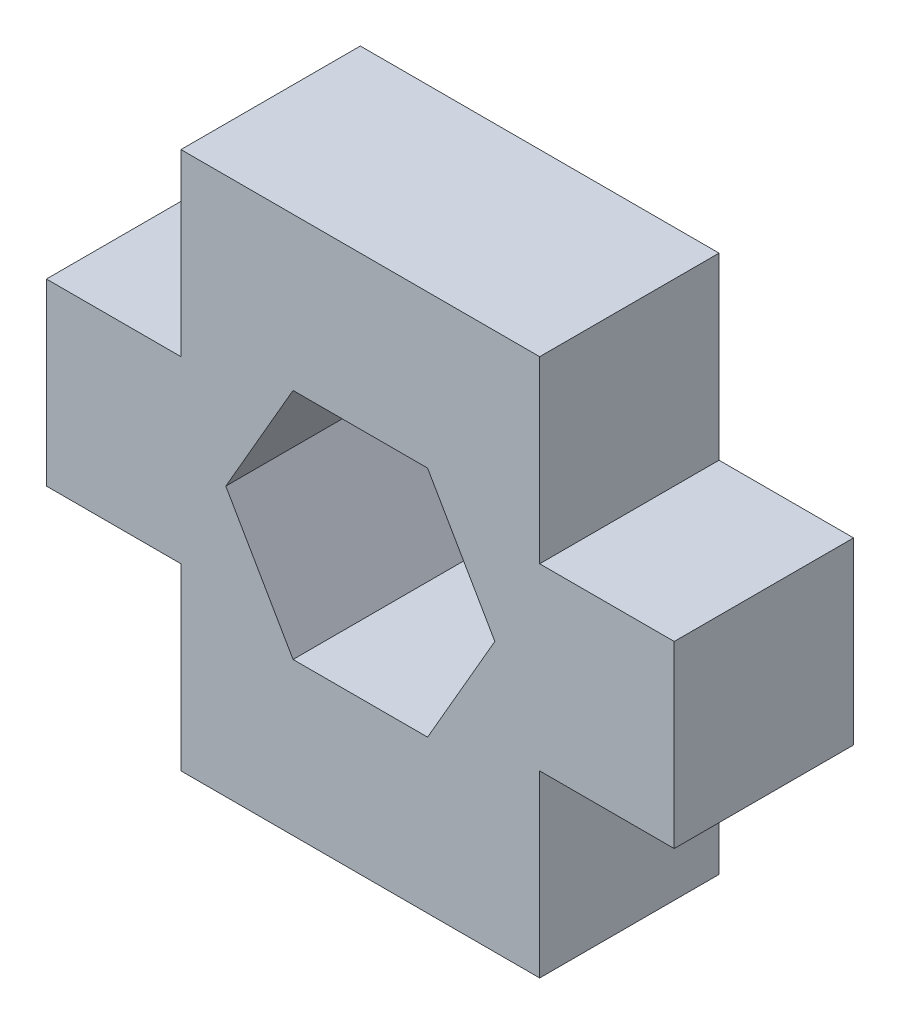
ISO-10303-21;
HEADER;
FILE_DESCRIPTION(('STEP AP214'),'2;1');
FILE_NAME('part.step','',(''),(''),'','','');
FILE_SCHEMA(('AUTOMOTIVE_DESIGN { 1 0 10303 214 1 1 1 1 }'));
ENDSEC;
DATA;
#1=APPLICATION_CONTEXT('core data for automotive mechanical design processes');
#2=APPLICATION_PROTOCOL_DEFINITION('international standard','automotive_design',2000,#1);
#3=PRODUCT_CONTEXT('',#1,'mechanical');
#4=PRODUCT('Part','Part','',(#3));
#5=PRODUCT_RELATED_PRODUCT_CATEGORY('part','',(#4));
#6=PRODUCT_DEFINITION_FORMATION('','',#4);
#7=PRODUCT_DEFINITION_CONTEXT('part definition',#1,'design');
#8=PRODUCT_DEFINITION('design','',#6,#7);
#9=PRODUCT_DEFINITION_SHAPE('','',#8);
#10=(LENGTH_UNIT() NAMED_UNIT(*) SI_UNIT(.MILLI.,.METRE.));
#11=(NAMED_UNIT(*) PLANE_ANGLE_UNIT() SI_UNIT($,.RADIAN.));
#12=(NAMED_UNIT(*) SI_UNIT($,.STERADIAN.) SOLID_ANGLE_UNIT());
#13=UNCERTAINTY_MEASURE_WITH_UNIT(LENGTH_MEASURE(1.E-05),#10,'distance_accuracy_value','');
#14=(GEOMETRIC_REPRESENTATION_CONTEXT(3) GLOBAL_UNCERTAINTY_ASSIGNED_CONTEXT((#13)) GLOBAL_UNIT_ASSIGNED_CONTEXT((#10,
#11,#12)) REPRESENTATION_CONTEXT('',''));
#15=CARTESIAN_POINT('',(0.,0.,0.));
#16=DIRECTION('',(0.,0.,1.));
#17=DIRECTION('',(1.,0.,0.));
#18=AXIS2_PLACEMENT_3D('',#15,#16,#17);
#19=CARTESIAN_POINT('',(0.,0.,4.));
#20=DIRECTION('',(0.,0.,1.));
#21=DIRECTION('',(1.,0.,0.));
#22=AXIS2_PLACEMENT_3D('',#19,#20,#21);
#23=PLANE('',#22);
#24=DIRECTION('',(0.,-1.,0.));
#25=VECTOR('',#24,1.);
#26=CARTESIAN_POINT('',(0.,4.,4.));
#27=LINE('',#26,#25);
#28=CARTESIAN_POINT('',(0.,4.,4.));
#29=VERTEX_POINT('',#28);
#30=CARTESIAN_POINT('',(0.,0.,4.));
#31=VERTEX_POINT('',#30);
#32=EDGE_CURVE('E209',#29,#31,#27,.T.);
#33=ORIENTED_EDGE('',*,*,#32,.T.);
#34=DIRECTION('',(1.,0.,0.));
#35=VECTOR('',#34,1.);
#36=CARTESIAN_POINT('',(0.,0.,4.));
#37=LINE('',#36,#35);
#38=CARTESIAN_POINT('',(8.,0.,4.));
#39=VERTEX_POINT('',#38);
#40=EDGE_CURVE('E212',#31,#39,#37,.T.);
#41=ORIENTED_EDGE('',*,*,#40,.T.);
#42=DIRECTION('',(0.,1.,0.));
#43=VECTOR('',#42,1.);
#44=CARTESIAN_POINT('',(8.,0.,4.));
#45=LINE('',#44,#43);
#46=CARTESIAN_POINT('',(8.,4.,4.));
#47=VERTEX_POINT('',#46);
#48=EDGE_CURVE('E215',#39,#47,#45,.T.);
#49=ORIENTED_EDGE('',*,*,#48,.T.);
#50=DIRECTION('',(1.,0.,0.));
#51=VECTOR('',#50,1.);
#52=CARTESIAN_POINT('',(8.,4.,4.));
#53=LINE('',#52,#51);
#54=CARTESIAN_POINT('',(11.,4.,4.));
#55=VERTEX_POINT('',#54);
#56=EDGE_CURVE('E217',#47,#55,#53,.T.);
#57=ORIENTED_EDGE('',*,*,#56,.T.);
#58=DIRECTION('',(0.,1.,0.));
#59=VECTOR('',#58,1.);
#60=CARTESIAN_POINT('',(11.,4.,4.));
#61=LINE('',#60,#59);
#62=CARTESIAN_POINT('',(11.,8.,4.));
#63=VERTEX_POINT('',#62);
#64=EDGE_CURVE('E219',#55,#63,#61,.T.);
#65=ORIENTED_EDGE('',*,*,#64,.T.);
#66=DIRECTION('',(-1.,0.,0.));
#67=VECTOR('',#66,1.);
#68=CARTESIAN_POINT('',(8.,8.,4.));
#69=LINE('',#68,#67);
#70=CARTESIAN_POINT('',(8.,8.,4.));
#71=VERTEX_POINT('',#70);
#72=EDGE_CURVE('E221',#63,#71,#69,.T.);
#73=ORIENTED_EDGE('',*,*,#72,.T.);
#74=DIRECTION('',(0.,1.,0.));
#75=VECTOR('',#74,1.);
#76=CARTESIAN_POINT('',(8.,8.,4.));
#77=LINE('',#76,#75);
#78=CARTESIAN_POINT('',(8.,12.,4.));
#79=VERTEX_POINT('',#78);
#80=EDGE_CURVE('E223',#71,#79,#77,.T.);
#81=ORIENTED_EDGE('',*,*,#80,.T.);
#82=DIRECTION('',(-1.,0.,0.));
#83=VECTOR('',#82,1.);
#84=CARTESIAN_POINT('',(8.,12.,4.));
#85=LINE('',#84,#83);
#86=CARTESIAN_POINT('',(0.,12.,4.));
#87=VERTEX_POINT('',#86);
#88=EDGE_CURVE('E225',#79,#87,#85,.T.);
#89=ORIENTED_EDGE('',*,*,#88,.T.);
#90=DIRECTION('',(0.,-1.,0.));
#91=VECTOR('',#90,1.);
#92=CARTESIAN_POINT('',(0.,12.,4.));
#93=LINE('',#92,#91);
#94=CARTESIAN_POINT('',(0.,8.,4.));
#95=VERTEX_POINT('',#94);
#96=EDGE_CURVE('E227',#87,#95,#93,.T.);
#97=ORIENTED_EDGE('',*,*,#96,.T.);
#98=DIRECTION('',(-1.,0.,0.));
#99=VECTOR('',#98,1.);
#100=CARTESIAN_POINT('',(0.,8.,4.));
#101=LINE('',#100,#99);
#102=CARTESIAN_POINT('',(-3.,8.,4.));
#103=VERTEX_POINT('',#102);
#104=EDGE_CURVE('E229',#95,#103,#101,.T.);
#105=ORIENTED_EDGE('',*,*,#104,.T.);
#106=DIRECTION('',(0.,-1.,0.));
#107=VECTOR('',#106,1.);
#108=CARTESIAN_POINT('',(-3.,8.,4.));
#109=LINE('',#108,#107);
#110=CARTESIAN_POINT('',(-3.,4.,4.));
#111=VERTEX_POINT('',#110);
#112=EDGE_CURVE('E231',#103,#111,#109,.T.);
#113=ORIENTED_EDGE('',*,*,#112,.T.);
#114=DIRECTION('',(1.,0.,0.));
#115=VECTOR('',#114,1.);
#116=CARTESIAN_POINT('',(-3.,4.,4.));
#117=LINE('',#116,#115);
#118=EDGE_CURVE('E233',#111,#29,#117,.T.);
#119=ORIENTED_EDGE('',*,*,#118,.T.);
#120=EDGE_LOOP('',(#33,#41,#49,#57,#65,#73,#81,#89,#97,#105,#113,#119));
#121=FACE_BOUND('',#120,.T.);
#122=DIRECTION('',(-0.5,0.866025403784439,0.));
#123=VECTOR('',#122,1.);
#124=CARTESIAN_POINT('',(7.00000000000003,5.99999999999998,4.));
#125=LINE('',#124,#123);
#126=CARTESIAN_POINT('',(7.00000000000003,5.99999999999998,4.));
#127=VERTEX_POINT('',#126);
#128=CARTESIAN_POINT('',(5.50000000000002,8.59807621135331,4.));
#129=VERTEX_POINT('',#128);
#130=EDGE_CURVE('E166',#127,#129,#125,.T.);
#131=ORIENTED_EDGE('',*,*,#130,.F.);
#132=DIRECTION('',(0.5,0.866025403784439,0.));
#133=VECTOR('',#132,1.);
#134=CARTESIAN_POINT('',(5.50000000000002,3.40192378864665,4.));
#135=LINE('',#134,#133);
#136=CARTESIAN_POINT('',(5.50000000000002,3.40192378864665,4.));
#137=VERTEX_POINT('',#136);
#138=EDGE_CURVE('E158',#137,#127,#135,.T.);
#139=ORIENTED_EDGE('',*,*,#138,.F.);
#140=DIRECTION('',(1.,0.,0.));
#141=VECTOR('',#140,1.);
#142=CARTESIAN_POINT('',(2.50000000000001,3.40192378864666,4.));
#143=LINE('',#142,#141);
#144=CARTESIAN_POINT('',(2.50000000000001,3.40192378864666,4.));
#145=VERTEX_POINT('',#144);
#146=EDGE_CURVE('E187',#145,#137,#143,.T.);
#147=ORIENTED_EDGE('',*,*,#146,.F.);
#148=DIRECTION('',(0.5,-0.866025403784438,0.));
#149=VECTOR('',#148,1.);
#150=CARTESIAN_POINT('',(1.,5.99999999999998,4.));
#151=LINE('',#150,#149);
#152=CARTESIAN_POINT('',(1.,5.99999999999998,4.));
#153=VERTEX_POINT('',#152);
#154=EDGE_CURVE('E185',#153,#145,#151,.T.);
#155=ORIENTED_EDGE('',*,*,#154,.F.);
#156=DIRECTION('',(-0.5,-0.866025403784439,0.));
#157=VECTOR('',#156,1.);
#158=CARTESIAN_POINT('',(2.50000000000001,8.59807621135331,4.));
#159=LINE('',#158,#157);
#160=CARTESIAN_POINT('',(2.50000000000001,8.59807621135331,4.));
#161=VERTEX_POINT('',#160);
#162=EDGE_CURVE('E181',#161,#153,#159,.T.);
#163=ORIENTED_EDGE('',*,*,#162,.F.);
#164=DIRECTION('',(-1.,0.,0.));
#165=VECTOR('',#164,1.);
#166=CARTESIAN_POINT('',(5.50000000000002,8.59807621135331,4.));
#167=LINE('',#166,#165);
#168=EDGE_CURVE('E179',#129,#161,#167,.T.);
#169=ORIENTED_EDGE('',*,*,#168,.F.);
#170=EDGE_LOOP('',(#131,#139,#147,#155,#163,#169));
#171=FACE_BOUND('',#170,.T.);
#172=ADVANCED_FACE('F33',(#121,#171),#23,.T.);
#173=CARTESIAN_POINT('',(0.,0.,0.));
#174=DIRECTION('',(0.,0.,1.));
#175=DIRECTION('',(1.,0.,0.));
#176=AXIS2_PLACEMENT_3D('',#173,#174,#175);
#177=PLANE('',#176);
#178=DIRECTION('',(0.,-1.,0.));
#179=VECTOR('',#178,1.);
#180=CARTESIAN_POINT('',(0.,4.,0.));
#181=LINE('',#180,#179);
#182=CARTESIAN_POINT('',(0.,4.,0.));
#183=VERTEX_POINT('',#182);
#184=CARTESIAN_POINT('',(0.,0.,0.));
#185=VERTEX_POINT('',#184);
#186=EDGE_CURVE('E174',#183,#185,#181,.T.);
#187=ORIENTED_EDGE('',*,*,#186,.F.);
#188=DIRECTION('',(1.,0.,0.));
#189=VECTOR('',#188,1.);
#190=CARTESIAN_POINT('',(-3.,4.,0.));
#191=LINE('',#190,#189);
#192=CARTESIAN_POINT('',(-3.,4.,0.));
#193=VERTEX_POINT('',#192);
#194=EDGE_CURVE('E213',#193,#183,#191,.T.);
#195=ORIENTED_EDGE('',*,*,#194,.F.);
#196=DIRECTION('',(0.,-1.,0.));
#197=VECTOR('',#196,1.);
#198=CARTESIAN_POINT('',(-3.,8.,0.));
#199=LINE('',#198,#197);
#200=CARTESIAN_POINT('',(-3.,8.,0.));
#201=VERTEX_POINT('',#200);
#202=EDGE_CURVE('E256',#201,#193,#199,.T.);
#203=ORIENTED_EDGE('',*,*,#202,.F.);
#204=DIRECTION('',(-1.,0.,0.));
#205=VECTOR('',#204,1.);
#206=CARTESIAN_POINT('',(0.,8.,0.));
#207=LINE('',#206,#205);
#208=CARTESIAN_POINT('',(0.,8.,0.));
#209=VERTEX_POINT('',#208);
#210=EDGE_CURVE('E254',#209,#201,#207,.T.);
#211=ORIENTED_EDGE('',*,*,#210,.F.);
#212=DIRECTION('',(0.,-1.,0.));
#213=VECTOR('',#212,1.);
#214=CARTESIAN_POINT('',(0.,12.,0.));
#215=LINE('',#214,#213);
#216=CARTESIAN_POINT('',(0.,12.,0.));
#217=VERTEX_POINT('',#216);
#218=EDGE_CURVE('E252',#217,#209,#215,.T.);
#219=ORIENTED_EDGE('',*,*,#218,.F.);
#220=DIRECTION('',(-1.,0.,0.));
#221=VECTOR('',#220,1.);
#222=CARTESIAN_POINT('',(8.,12.,0.));
#223=LINE('',#222,#221);
#224=CARTESIAN_POINT('',(8.,12.,0.));
#225=VERTEX_POINT('',#224);
#226=EDGE_CURVE('E250',#225,#217,#223,.T.);
#227=ORIENTED_EDGE('',*,*,#226,.F.);
#228=DIRECTION('',(0.,1.,0.));
#229=VECTOR('',#228,1.);
#230=CARTESIAN_POINT('',(8.,8.,0.));
#231=LINE('',#230,#229);
#232=CARTESIAN_POINT('',(8.,8.,0.));
#233=VERTEX_POINT('',#232);
#234=EDGE_CURVE('E248',#233,#225,#231,.T.);
#235=ORIENTED_EDGE('',*,*,#234,.F.);
#236=DIRECTION('',(-1.,0.,0.));
#237=VECTOR('',#236,1.);
#238=CARTESIAN_POINT('',(8.,8.,0.));
#239=LINE('',#238,#237);
#240=CARTESIAN_POINT('',(11.,8.,0.));
#241=VERTEX_POINT('',#240);
#242=EDGE_CURVE('E246',#241,#233,#239,.T.);
#243=ORIENTED_EDGE('',*,*,#242,.F.);
#244=DIRECTION('',(0.,1.,0.));
#245=VECTOR('',#244,1.);
#246=CARTESIAN_POINT('',(11.,4.,0.));
#247=LINE('',#246,#245);
#248=CARTESIAN_POINT('',(11.,4.,0.));
#249=VERTEX_POINT('',#248);
#250=EDGE_CURVE('E244',#249,#241,#247,.T.);
#251=ORIENTED_EDGE('',*,*,#250,.F.);
#252=DIRECTION('',(1.,0.,0.));
#253=VECTOR('',#252,1.);
#254=CARTESIAN_POINT('',(8.,4.,0.));
#255=LINE('',#254,#253);
#256=CARTESIAN_POINT('',(8.,4.,0.));
#257=VERTEX_POINT('',#256);
#258=EDGE_CURVE('E242',#257,#249,#255,.T.);
#259=ORIENTED_EDGE('',*,*,#258,.F.);
#260=DIRECTION('',(0.,1.,0.));
#261=VECTOR('',#260,1.);
#262=CARTESIAN_POINT('',(8.,0.,0.));
#263=LINE('',#262,#261);
#264=CARTESIAN_POINT('',(8.,0.,0.));
#265=VERTEX_POINT('',#264);
#266=EDGE_CURVE('E240',#265,#257,#263,.T.);
#267=ORIENTED_EDGE('',*,*,#266,.F.);
#268=DIRECTION('',(1.,0.,0.));
#269=VECTOR('',#268,1.);
#270=CARTESIAN_POINT('',(0.,0.,0.));
#271=LINE('',#270,#269);
#272=EDGE_CURVE('E238',#185,#265,#271,.T.);
#273=ORIENTED_EDGE('',*,*,#272,.F.);
#274=EDGE_LOOP('',(#187,#195,#203,#211,#219,#227,#235,#243,#251,#259,#267,#273));
#275=FACE_BOUND('',#274,.T.);
#276=DIRECTION('',(0.5,0.866025403784439,0.));
#277=VECTOR('',#276,1.);
#278=CARTESIAN_POINT('',(5.50000000000002,3.40192378864665,0.));
#279=LINE('',#278,#277);
#280=CARTESIAN_POINT('',(5.50000000000002,3.40192378864665,0.));
#281=VERTEX_POINT('',#280);
#282=CARTESIAN_POINT('',(7.00000000000003,5.99999999999998,0.));
#283=VERTEX_POINT('',#282);
#284=EDGE_CURVE('E56',#281,#283,#279,.T.);
#285=ORIENTED_EDGE('',*,*,#284,.T.);
#286=DIRECTION('',(-0.5,0.866025403784439,0.));
#287=VECTOR('',#286,1.);
#288=CARTESIAN_POINT('',(7.00000000000003,5.99999999999998,0.));
#289=LINE('',#288,#287);
#290=CARTESIAN_POINT('',(5.50000000000002,8.59807621135331,0.));
#291=VERTEX_POINT('',#290);
#292=EDGE_CURVE('E173',#283,#291,#289,.T.);
#293=ORIENTED_EDGE('',*,*,#292,.T.);
#294=DIRECTION('',(-1.,0.,0.));
#295=VECTOR('',#294,1.);
#296=CARTESIAN_POINT('',(5.50000000000002,8.59807621135331,0.));
#297=LINE('',#296,#295);
#298=CARTESIAN_POINT('',(2.50000000000001,8.59807621135331,0.));
#299=VERTEX_POINT('',#298);
#300=EDGE_CURVE('E191',#291,#299,#297,.T.);
#301=ORIENTED_EDGE('',*,*,#300,.T.);
#302=DIRECTION('',(-0.5,-0.866025403784439,0.));
#303=VECTOR('',#302,1.);
#304=CARTESIAN_POINT('',(2.50000000000001,8.59807621135331,0.));
#305=LINE('',#304,#303);
#306=CARTESIAN_POINT('',(1.,5.99999999999998,0.));
#307=VERTEX_POINT('',#306);
#308=EDGE_CURVE('E194',#299,#307,#305,.T.);
#309=ORIENTED_EDGE('',*,*,#308,.T.);
#310=DIRECTION('',(0.5,-0.866025403784438,0.));
#311=VECTOR('',#310,1.);
#312=CARTESIAN_POINT('',(1.,5.99999999999998,0.));
#313=LINE('',#312,#311);
#314=CARTESIAN_POINT('',(2.50000000000001,3.40192378864666,0.));
#315=VERTEX_POINT('',#314);
#316=EDGE_CURVE('E197',#307,#315,#313,.T.);
#317=ORIENTED_EDGE('',*,*,#316,.T.);
#318=DIRECTION('',(1.,0.,0.));
#319=VECTOR('',#318,1.);
#320=CARTESIAN_POINT('',(2.50000000000001,3.40192378864666,0.));
#321=LINE('',#320,#319);
#322=EDGE_CURVE('E167',#315,#281,#321,.T.);
#323=ORIENTED_EDGE('',*,*,#322,.T.);
#324=EDGE_LOOP('',(#285,#293,#301,#309,#317,#323));
#325=FACE_BOUND('',#324,.T.);
#326=ADVANCED_FACE('F298',(#275,#325),#177,.F.);
#327=CARTESIAN_POINT('',(0.,4.,4.));
#328=DIRECTION('',(1.,0.,0.));
#329=DIRECTION('',(0.,0.,-1.));
#330=AXIS2_PLACEMENT_3D('',#327,#328,#329);
#331=PLANE('',#330);
#332=ORIENTED_EDGE('',*,*,#186,.T.);
#333=DIRECTION('',(0.,0.,-1.));
#334=VECTOR('',#333,1.);
#335=CARTESIAN_POINT('',(0.,0.,4.));
#336=LINE('',#335,#334);
#337=EDGE_CURVE('E11',#31,#185,#336,.T.);
#338=ORIENTED_EDGE('',*,*,#337,.F.);
#339=ORIENTED_EDGE('',*,*,#32,.F.);
#340=DIRECTION('',(0.,0.,-1.));
#341=VECTOR('',#340,1.);
#342=CARTESIAN_POINT('',(0.,4.,4.));
#343=LINE('',#342,#341);
#344=EDGE_CURVE('E235',#29,#183,#343,.T.);
#345=ORIENTED_EDGE('',*,*,#344,.T.);
#346=EDGE_LOOP('',(#332,#338,#339,#345));
#347=FACE_BOUND('',#346,.T.);
#348=ADVANCED_FACE('F35',(#347),#331,.F.);
#349=CARTESIAN_POINT('',(0.,0.,4.));
#350=DIRECTION('',(0.,1.,0.));
#351=DIRECTION('',(0.,0.,1.));
#352=AXIS2_PLACEMENT_3D('',#349,#350,#351);
#353=PLANE('',#352);
#354=ORIENTED_EDGE('',*,*,#272,.T.);
#355=DIRECTION('',(0.,0.,-1.));
#356=VECTOR('',#355,1.);
#357=CARTESIAN_POINT('',(8.,0.,4.));
#358=LINE('',#357,#356);
#359=EDGE_CURVE('E41',#39,#265,#358,.T.);
#360=ORIENTED_EDGE('',*,*,#359,.F.);
#361=ORIENTED_EDGE('',*,*,#40,.F.);
#362=ORIENTED_EDGE('',*,*,#337,.T.);
#363=EDGE_LOOP('',(#354,#360,#361,#362));
#364=FACE_BOUND('',#363,.T.);
#365=ADVANCED_FACE('F315',(#364),#353,.F.);
#366=CARTESIAN_POINT('',(8.,0.,4.));
#367=DIRECTION('',(-1.,0.,0.));
#368=DIRECTION('',(0.,0.,1.));
#369=AXIS2_PLACEMENT_3D('',#366,#367,#368);
#370=PLANE('',#369);
#371=ORIENTED_EDGE('',*,*,#266,.T.);
#372=DIRECTION('',(0.,0.,-1.));
#373=VECTOR('',#372,1.);
#374=CARTESIAN_POINT('',(8.,4.,4.));
#375=LINE('',#374,#373);
#376=EDGE_CURVE('E285',#47,#257,#375,.T.);
#377=ORIENTED_EDGE('',*,*,#376,.F.);
#378=ORIENTED_EDGE('',*,*,#48,.F.);
#379=ORIENTED_EDGE('',*,*,#359,.T.);
#380=EDGE_LOOP('',(#371,#377,#378,#379));
#381=FACE_BOUND('',#380,.T.);
#382=ADVANCED_FACE('F292',(#381),#370,.F.);
#383=CARTESIAN_POINT('',(8.,4.,4.));
#384=DIRECTION('',(0.,1.,0.));
#385=DIRECTION('',(-1.,0.,0.));
#386=AXIS2_PLACEMENT_3D('',#383,#384,#385);
#387=PLANE('',#386);
#388=ORIENTED_EDGE('',*,*,#258,.T.);
#389=DIRECTION('',(0.,0.,-1.));
#390=VECTOR('',#389,1.);
#391=CARTESIAN_POINT('',(11.,4.,4.));
#392=LINE('',#391,#390);
#393=EDGE_CURVE('E282',#55,#249,#392,.T.);
#394=ORIENTED_EDGE('',*,*,#393,.F.);
#395=ORIENTED_EDGE('',*,*,#56,.F.);
#396=ORIENTED_EDGE('',*,*,#376,.T.);
#397=EDGE_LOOP('',(#388,#394,#395,#396));
#398=FACE_BOUND('',#397,.T.);
#399=ADVANCED_FACE('F304',(#398),#387,.F.);
#400=CARTESIAN_POINT('',(11.,4.,4.));
#401=DIRECTION('',(-1.,0.,0.));
#402=DIRECTION('',(0.,0.,1.));
#403=AXIS2_PLACEMENT_3D('',#400,#401,#402);
#404=PLANE('',#403);
#405=ORIENTED_EDGE('',*,*,#250,.T.);
#406=DIRECTION('',(0.,0.,-1.));
#407=VECTOR('',#406,1.);
#408=CARTESIAN_POINT('',(11.,8.,4.));
#409=LINE('',#408,#407);
#410=EDGE_CURVE('E279',#63,#241,#409,.T.);
#411=ORIENTED_EDGE('',*,*,#410,.F.);
#412=ORIENTED_EDGE('',*,*,#64,.F.);
#413=ORIENTED_EDGE('',*,*,#393,.T.);
#414=EDGE_LOOP('',(#405,#411,#412,#413));
#415=FACE_BOUND('',#414,.T.);
#416=ADVANCED_FACE('F308',(#415),#404,.F.);
#417=CARTESIAN_POINT('',(8.,8.,4.));
#418=DIRECTION('',(0.,-1.,0.));
#419=DIRECTION('',(0.,0.,-1.));
#420=AXIS2_PLACEMENT_3D('',#417,#418,#419);
#421=PLANE('',#420);
#422=ORIENTED_EDGE('',*,*,#242,.T.);
#423=DIRECTION('',(0.,0.,-1.));
#424=VECTOR('',#423,1.);
#425=CARTESIAN_POINT('',(8.,8.,4.));
#426=LINE('',#425,#424);
#427=EDGE_CURVE('E276',#71,#233,#426,.T.);
#428=ORIENTED_EDGE('',*,*,#427,.F.);
#429=ORIENTED_EDGE('',*,*,#72,.F.);
#430=ORIENTED_EDGE('',*,*,#410,.T.);
#431=EDGE_LOOP('',(#422,#428,#429,#430));
#432=FACE_BOUND('',#431,.T.);
#433=ADVANCED_FACE('F348',(#432),#421,.F.);
#434=CARTESIAN_POINT('',(8.,8.,4.));
#435=DIRECTION('',(-1.,0.,0.));
#436=DIRECTION('',(0.,0.,1.));
#437=AXIS2_PLACEMENT_3D('',#434,#435,#436);
#438=PLANE('',#437);
#439=ORIENTED_EDGE('',*,*,#234,.T.);
#440=DIRECTION('',(0.,0.,-1.));
#441=VECTOR('',#440,1.);
#442=CARTESIAN_POINT('',(8.,12.,4.));
#443=LINE('',#442,#441);
#444=EDGE_CURVE('E273',#79,#225,#443,.T.);
#445=ORIENTED_EDGE('',*,*,#444,.F.);
#446=ORIENTED_EDGE('',*,*,#80,.F.);
#447=ORIENTED_EDGE('',*,*,#427,.T.);
#448=EDGE_LOOP('',(#439,#445,#446,#447));
#449=FACE_BOUND('',#448,.T.);
#450=ADVANCED_FACE('F346',(#449),#438,.F.);
#451=CARTESIAN_POINT('',(8.,12.,4.));
#452=DIRECTION('',(0.,-1.,0.));
#453=DIRECTION('',(0.,0.,-1.));
#454=AXIS2_PLACEMENT_3D('',#451,#452,#453);
#455=PLANE('',#454);
#456=ORIENTED_EDGE('',*,*,#226,.T.);
#457=DIRECTION('',(0.,0.,-1.));
#458=VECTOR('',#457,1.);
#459=CARTESIAN_POINT('',(0.,12.,4.));
#460=LINE('',#459,#458);
#461=EDGE_CURVE('E270',#87,#217,#460,.T.);
#462=ORIENTED_EDGE('',*,*,#461,.F.);
#463=ORIENTED_EDGE('',*,*,#88,.F.);
#464=ORIENTED_EDGE('',*,*,#444,.T.);
#465=EDGE_LOOP('',(#456,#462,#463,#464));
#466=FACE_BOUND('',#465,.T.);
#467=ADVANCED_FACE('F342',(#466),#455,.F.);
#468=CARTESIAN_POINT('',(0.,12.,4.));
#469=DIRECTION('',(1.,0.,0.));
#470=DIRECTION('',(0.,0.,-1.));
#471=AXIS2_PLACEMENT_3D('',#468,#469,#470);
#472=PLANE('',#471);
#473=ORIENTED_EDGE('',*,*,#218,.T.);
#474=DIRECTION('',(0.,0.,-1.));
#475=VECTOR('',#474,1.);
#476=CARTESIAN_POINT('',(0.,8.,4.));
#477=LINE('',#476,#475);
#478=EDGE_CURVE('E267',#95,#209,#477,.T.);
#479=ORIENTED_EDGE('',*,*,#478,.F.);
#480=ORIENTED_EDGE('',*,*,#96,.F.);
#481=ORIENTED_EDGE('',*,*,#461,.T.);
#482=EDGE_LOOP('',(#473,#479,#480,#481));
#483=FACE_BOUND('',#482,.T.);
#484=ADVANCED_FACE('F337',(#483),#472,.F.);
#485=CARTESIAN_POINT('',(0.,8.,4.));
#486=DIRECTION('',(0.,-1.,0.));
#487=DIRECTION('',(0.,0.,-1.));
#488=AXIS2_PLACEMENT_3D('',#485,#486,#487);
#489=PLANE('',#488);
#490=ORIENTED_EDGE('',*,*,#210,.T.);
#491=DIRECTION('',(0.,0.,-1.));
#492=VECTOR('',#491,1.);
#493=CARTESIAN_POINT('',(-3.,8.,4.));
#494=LINE('',#493,#492);
#495=EDGE_CURVE('E264',#103,#201,#494,.T.);
#496=ORIENTED_EDGE('',*,*,#495,.F.);
#497=ORIENTED_EDGE('',*,*,#104,.F.);
#498=ORIENTED_EDGE('',*,*,#478,.T.);
#499=EDGE_LOOP('',(#490,#496,#497,#498));
#500=FACE_BOUND('',#499,.T.);
#501=ADVANCED_FACE('F331',(#500),#489,.F.);
#502=CARTESIAN_POINT('',(-3.,8.,4.));
#503=DIRECTION('',(1.,0.,0.));
#504=DIRECTION('',(0.,0.,-1.));
#505=AXIS2_PLACEMENT_3D('',#502,#503,#504);
#506=PLANE('',#505);
#507=ORIENTED_EDGE('',*,*,#202,.T.);
#508=DIRECTION('',(0.,0.,-1.));
#509=VECTOR('',#508,1.);
#510=CARTESIAN_POINT('',(-3.,4.,4.));
#511=LINE('',#510,#509);
#512=EDGE_CURVE('E261',#111,#193,#511,.T.);
#513=ORIENTED_EDGE('',*,*,#512,.F.);
#514=ORIENTED_EDGE('',*,*,#112,.F.);
#515=ORIENTED_EDGE('',*,*,#495,.T.);
#516=EDGE_LOOP('',(#507,#513,#514,#515));
#517=FACE_BOUND('',#516,.T.);
#518=ADVANCED_FACE('F327',(#517),#506,.F.);
#519=CARTESIAN_POINT('',(-3.,4.,4.));
#520=DIRECTION('',(0.,1.,0.));
#521=DIRECTION('',(0.,0.,1.));
#522=AXIS2_PLACEMENT_3D('',#519,#520,#521);
#523=PLANE('',#522);
#524=ORIENTED_EDGE('',*,*,#194,.T.);
#525=ORIENTED_EDGE('',*,*,#344,.F.);
#526=ORIENTED_EDGE('',*,*,#118,.F.);
#527=ORIENTED_EDGE('',*,*,#512,.T.);
#528=EDGE_LOOP('',(#524,#525,#526,#527));
#529=FACE_BOUND('',#528,.T.);
#530=ADVANCED_FACE('F322',(#529),#523,.F.);
#531=CARTESIAN_POINT('',(5.50000000000002,3.40192378864665,4.));
#532=DIRECTION('',(-0.866025403784439,0.5,0.));
#533=DIRECTION('',(-0.5,-0.866025403784439,0.));
#534=AXIS2_PLACEMENT_3D('',#531,#532,#533);
#535=PLANE('',#534);
#536=ORIENTED_EDGE('',*,*,#284,.F.);
#537=DIRECTION('',(0.,0.,-1.));
#538=VECTOR('',#537,1.);
#539=CARTESIAN_POINT('',(5.50000000000002,3.40192378864665,4.));
#540=LINE('',#539,#538);
#541=EDGE_CURVE('E162',#137,#281,#540,.T.);
#542=ORIENTED_EDGE('',*,*,#541,.F.);
#543=ORIENTED_EDGE('',*,*,#138,.T.);
#544=DIRECTION('',(0.,0.,-1.));
#545=VECTOR('',#544,1.);
#546=CARTESIAN_POINT('',(7.00000000000003,5.99999999999998,4.));
#547=LINE('',#546,#545);
#548=EDGE_CURVE('E161',#127,#283,#547,.T.);
#549=ORIENTED_EDGE('',*,*,#548,.T.);
#550=EDGE_LOOP('',(#536,#542,#543,#549));
#551=FACE_BOUND('',#550,.T.);
#552=ADVANCED_FACE('F160',(#551),#535,.T.);
#553=CARTESIAN_POINT('',(7.00000000000003,5.99999999999998,4.));
#554=DIRECTION('',(-0.866025403784439,-0.5,0.));
#555=DIRECTION('',(0.5,-0.866025403784439,0.));
#556=AXIS2_PLACEMENT_3D('',#553,#554,#555);
#557=PLANE('',#556);
#558=ORIENTED_EDGE('',*,*,#292,.F.);
#559=ORIENTED_EDGE('',*,*,#548,.F.);
#560=ORIENTED_EDGE('',*,*,#130,.T.);
#561=DIRECTION('',(0.,0.,-1.));
#562=VECTOR('',#561,1.);
#563=CARTESIAN_POINT('',(5.50000000000002,8.59807621135331,4.));
#564=LINE('',#563,#562);
#565=EDGE_CURVE('E175',#129,#291,#564,.T.);
#566=ORIENTED_EDGE('',*,*,#565,.T.);
#567=EDGE_LOOP('',(#558,#559,#560,#566));
#568=FACE_BOUND('',#567,.T.);
#569=ADVANCED_FACE('F170',(#568),#557,.T.);
#570=CARTESIAN_POINT('',(5.50000000000002,8.59807621135331,4.));
#571=DIRECTION('',(0.,-1.,0.));
#572=DIRECTION('',(1.,0.,0.));
#573=AXIS2_PLACEMENT_3D('',#570,#571,#572);
#574=PLANE('',#573);
#575=ORIENTED_EDGE('',*,*,#300,.F.);
#576=ORIENTED_EDGE('',*,*,#565,.F.);
#577=ORIENTED_EDGE('',*,*,#168,.T.);
#578=DIRECTION('',(0.,0.,-1.));
#579=VECTOR('',#578,1.);
#580=CARTESIAN_POINT('',(2.50000000000001,8.59807621135331,4.));
#581=LINE('',#580,#579);
#582=EDGE_CURVE('E206',#161,#299,#581,.T.);
#583=ORIENTED_EDGE('',*,*,#582,.T.);
#584=EDGE_LOOP('',(#575,#576,#577,#583));
#585=FACE_BOUND('',#584,.T.);
#586=ADVANCED_FACE('F406',(#585),#574,.T.);
#587=CARTESIAN_POINT('',(2.50000000000001,8.59807621135331,4.));
#588=DIRECTION('',(0.866025403784439,-0.5,0.));
#589=DIRECTION('',(0.5,0.866025403784439,0.));
#590=AXIS2_PLACEMENT_3D('',#587,#588,#589);
#591=PLANE('',#590);
#592=ORIENTED_EDGE('',*,*,#308,.F.);
#593=ORIENTED_EDGE('',*,*,#582,.F.);
#594=ORIENTED_EDGE('',*,*,#162,.T.);
#595=DIRECTION('',(0.,0.,-1.));
#596=VECTOR('',#595,1.);
#597=CARTESIAN_POINT('',(1.,5.99999999999998,4.));
#598=LINE('',#597,#596);
#599=EDGE_CURVE('E204',#153,#307,#598,.T.);
#600=ORIENTED_EDGE('',*,*,#599,.T.);
#601=EDGE_LOOP('',(#592,#593,#594,#600));
#602=FACE_BOUND('',#601,.T.);
#603=ADVANCED_FACE('F412',(#602),#591,.T.);
#604=CARTESIAN_POINT('',(1.,5.99999999999998,4.));
#605=DIRECTION('',(0.866025403784438,0.5,0.));
#606=DIRECTION('',(-0.5,0.866025403784439,0.));
#607=AXIS2_PLACEMENT_3D('',#604,#605,#606);
#608=PLANE('',#607);
#609=ORIENTED_EDGE('',*,*,#316,.F.);
#610=ORIENTED_EDGE('',*,*,#599,.F.);
#611=ORIENTED_EDGE('',*,*,#154,.T.);
#612=DIRECTION('',(0.,0.,-1.));
#613=VECTOR('',#612,1.);
#614=CARTESIAN_POINT('',(2.50000000000001,3.40192378864666,4.));
#615=LINE('',#614,#613);
#616=EDGE_CURVE('E48',#145,#315,#615,.T.);
#617=ORIENTED_EDGE('',*,*,#616,.T.);
#618=EDGE_LOOP('',(#609,#610,#611,#617));
#619=FACE_BOUND('',#618,.T.);
#620=ADVANCED_FACE('F420',(#619),#608,.T.);
#621=CARTESIAN_POINT('',(2.50000000000001,3.40192378864666,4.));
#622=DIRECTION('',(0.,1.,0.));
#623=DIRECTION('',(-1.,0.,0.));
#624=AXIS2_PLACEMENT_3D('',#621,#622,#623);
#625=PLANE('',#624);
#626=ORIENTED_EDGE('',*,*,#322,.F.);
#627=ORIENTED_EDGE('',*,*,#616,.F.);
#628=ORIENTED_EDGE('',*,*,#146,.T.);
#629=ORIENTED_EDGE('',*,*,#541,.T.);
#630=EDGE_LOOP('',(#626,#627,#628,#629));
#631=FACE_BOUND('',#630,.T.);
#632=ADVANCED_FACE('F428',(#631),#625,.T.);
#633=CLOSED_SHELL('',(#172,#326,#348,#365,#382,#399,#416,#433,#450,#467,#484,#501,#518,#530,
#552,#569,#586,#603,#620,#632));
#634=MANIFOLD_SOLID_BREP('B2',#633);
#635=ADVANCED_BREP_SHAPE_REPRESENTATION('',(#18,#634),#14);
#636=SHAPE_DEFINITION_REPRESENTATION(#9,#635);
ENDSEC;
END-ISO-10303-21;
